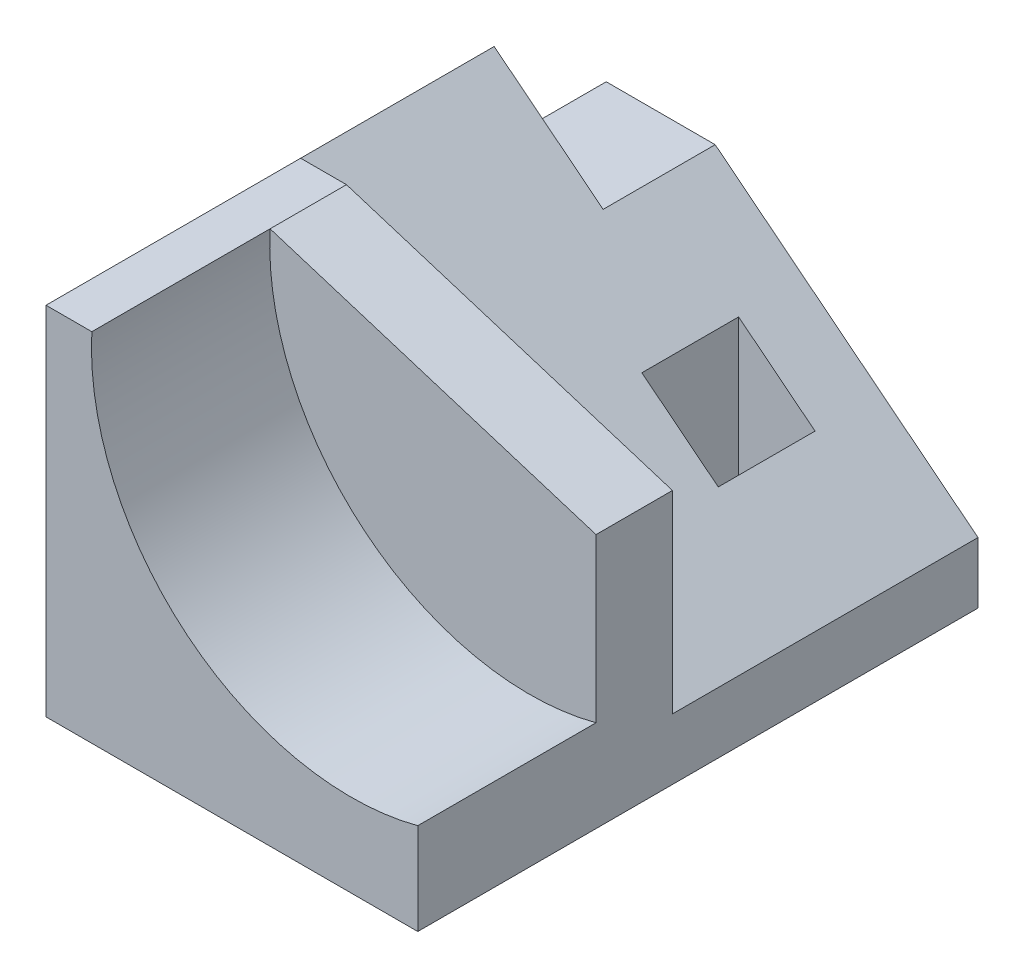
ISO-10303-21;
HEADER;
FILE_DESCRIPTION(('STEP AP214'),'2;1');
FILE_NAME('part.step','',(''),(''),'','','');
FILE_SCHEMA(('AUTOMOTIVE_DESIGN { 1 0 10303 214 1 1 1 1 }'));
ENDSEC;
DATA;
#1=APPLICATION_CONTEXT('core data for automotive mechanical design processes');
#2=APPLICATION_PROTOCOL_DEFINITION('international standard','automotive_design',2000,#1);
#3=PRODUCT_CONTEXT('',#1,'mechanical');
#4=PRODUCT('Part','Part','',(#3));
#5=PRODUCT_RELATED_PRODUCT_CATEGORY('part','',(#4));
#6=PRODUCT_DEFINITION_FORMATION('','',#4);
#7=PRODUCT_DEFINITION_CONTEXT('part definition',#1,'design');
#8=PRODUCT_DEFINITION('design','',#6,#7);
#9=PRODUCT_DEFINITION_SHAPE('','',#8);
#10=(LENGTH_UNIT() NAMED_UNIT(*) SI_UNIT(.MILLI.,.METRE.));
#11=(NAMED_UNIT(*) PLANE_ANGLE_UNIT() SI_UNIT($,.RADIAN.));
#12=(NAMED_UNIT(*) SI_UNIT($,.STERADIAN.) SOLID_ANGLE_UNIT());
#13=UNCERTAINTY_MEASURE_WITH_UNIT(LENGTH_MEASURE(1.E-05),#10,'distance_accuracy_value','');
#14=(GEOMETRIC_REPRESENTATION_CONTEXT(3) GLOBAL_UNCERTAINTY_ASSIGNED_CONTEXT((#13)) GLOBAL_UNIT_ASSIGNED_CONTEXT((#10,
#11,#12)) REPRESENTATION_CONTEXT('',''));
#15=CARTESIAN_POINT('',(0.,0.,0.));
#16=DIRECTION('',(0.,0.,1.));
#17=DIRECTION('',(1.,0.,0.));
#18=AXIS2_PLACEMENT_3D('',#15,#16,#17);
#19=CARTESIAN_POINT('',(0.,35.,0.));
#20=DIRECTION('',(0.,-1.,0.));
#21=DIRECTION('',(0.,0.,-1.));
#22=AXIS2_PLACEMENT_3D('',#19,#20,#21);
#23=PLANE('',#22);
#24=DIRECTION('',(0.,0.,1.));
#25=VECTOR('',#24,1.);
#26=CARTESIAN_POINT('',(-13.75,35.,9.99999999999999));
#27=LINE('',#26,#25);
#28=CARTESIAN_POINT('',(-13.75,35.,9.99999999999999));
#29=VERTEX_POINT('',#28);
#30=CARTESIAN_POINT('',(-13.75,35.,27.5));
#31=VERTEX_POINT('',#30);
#32=EDGE_CURVE('E54',#29,#31,#27,.T.);
#33=ORIENTED_EDGE('',*,*,#32,.F.);
#34=DIRECTION('',(0.,0.,1.));
#35=VECTOR('',#34,1.);
#36=CARTESIAN_POINT('',(-13.75,35.,-27.501));
#37=LINE('',#36,#35);
#38=CARTESIAN_POINT('',(-13.75,35.,2.49999999999999));
#39=VERTEX_POINT('',#38);
#40=EDGE_CURVE('E143',#39,#29,#37,.T.);
#41=ORIENTED_EDGE('',*,*,#40,.F.);
#42=DIRECTION('',(1.,0.,0.));
#43=VECTOR('',#42,1.);
#44=CARTESIAN_POINT('',(0.,35.,2.49999999999999));
#45=LINE('',#44,#43);
#46=CARTESIAN_POINT('',(-18.25,35.,2.49999999999999));
#47=VERTEX_POINT('',#46);
#48=EDGE_CURVE('E154',#47,#39,#45,.T.);
#49=ORIENTED_EDGE('',*,*,#48,.F.);
#50=DIRECTION('',(0.,0.,1.));
#51=VECTOR('',#50,1.);
#52=CARTESIAN_POINT('',(-18.25,35.,27.5));
#53=LINE('',#52,#51);
#54=CARTESIAN_POINT('',(-18.25,35.,27.5));
#55=VERTEX_POINT('',#54);
#56=EDGE_CURVE('E222',#47,#55,#53,.T.);
#57=ORIENTED_EDGE('',*,*,#56,.T.);
#58=DIRECTION('',(1.,0.,0.));
#59=VECTOR('',#58,1.);
#60=CARTESIAN_POINT('',(-18.25,35.,27.5));
#61=LINE('',#60,#59);
#62=EDGE_CURVE('E221',#55,#31,#61,.T.);
#63=ORIENTED_EDGE('',*,*,#62,.T.);
#64=EDGE_LOOP('',(#33,#41,#49,#57,#63));
#65=FACE_BOUND('',#64,.T.);
#66=ADVANCED_FACE('F39',(#65),#23,.F.);
#67=CARTESIAN_POINT('',(18.25,35.,27.5));
#68=DIRECTION('',(-1.,0.,0.));
#69=DIRECTION('',(0.,0.,1.));
#70=AXIS2_PLACEMENT_3D('',#67,#68,#69);
#71=PLANE('',#70);
#72=DIRECTION('',(0.,-1.,0.));
#73=VECTOR('',#72,1.);
#74=CARTESIAN_POINT('',(18.25,0.,2.49999999999999));
#75=LINE('',#74,#73);
#76=CARTESIAN_POINT('',(18.25,25.,2.49999999999999));
#77=VERTEX_POINT('',#76);
#78=CARTESIAN_POINT('',(18.25,5.99999999999999,2.49999999999999));
#79=VERTEX_POINT('',#78);
#80=EDGE_CURVE('E163',#77,#79,#75,.T.);
#81=ORIENTED_EDGE('',*,*,#80,.F.);
#82=DIRECTION('',(0.,0.,1.));
#83=VECTOR('',#82,1.);
#84=CARTESIAN_POINT('',(18.25,25.,-27.501));
#85=LINE('',#84,#83);
#86=CARTESIAN_POINT('',(18.25,25.,9.99999999999999));
#87=VERTEX_POINT('',#86);
#88=EDGE_CURVE('E146',#77,#87,#85,.T.);
#89=ORIENTED_EDGE('',*,*,#88,.T.);
#90=DIRECTION('',(0.,1.,0.));
#91=VECTOR('',#90,1.);
#92=CARTESIAN_POINT('',(18.25,0.,9.99999999999999));
#93=LINE('',#92,#91);
#94=CARTESIAN_POINT('',(18.25,9.,9.99999999999999));
#95=VERTEX_POINT('',#94);
#96=EDGE_CURVE('E274',#95,#87,#93,.T.);
#97=ORIENTED_EDGE('',*,*,#96,.F.);
#98=DIRECTION('',(0.,0.,1.));
#99=VECTOR('',#98,1.);
#100=CARTESIAN_POINT('',(18.25,9.,9.99999999999999));
#101=LINE('',#100,#99);
#102=CARTESIAN_POINT('',(18.25,9.,27.5));
#103=VERTEX_POINT('',#102);
#104=EDGE_CURVE('E168',#95,#103,#101,.T.);
#105=ORIENTED_EDGE('',*,*,#104,.T.);
#106=DIRECTION('',(0.,-1.,0.));
#107=VECTOR('',#106,1.);
#108=CARTESIAN_POINT('',(18.25,35.,27.5));
#109=LINE('',#108,#107);
#110=CARTESIAN_POINT('',(18.25,0.,27.5));
#111=VERTEX_POINT('',#110);
#112=EDGE_CURVE('E224',#103,#111,#109,.T.);
#113=ORIENTED_EDGE('',*,*,#112,.T.);
#114=DIRECTION('',(0.,0.,-1.));
#115=VECTOR('',#114,1.);
#116=CARTESIAN_POINT('',(18.25,0.,27.5));
#117=LINE('',#116,#115);
#118=CARTESIAN_POINT('',(18.25,0.,-27.5));
#119=VERTEX_POINT('',#118);
#120=EDGE_CURVE('E218',#111,#119,#117,.T.);
#121=ORIENTED_EDGE('',*,*,#120,.T.);
#122=DIRECTION('',(0.,-1.,0.));
#123=VECTOR('',#122,1.);
#124=CARTESIAN_POINT('',(18.25,35.,-27.5));
#125=LINE('',#124,#123);
#126=CARTESIAN_POINT('',(18.25,5.99999999999999,-27.5));
#127=VERTEX_POINT('',#126);
#128=EDGE_CURVE('E47',#127,#119,#125,.T.);
#129=ORIENTED_EDGE('',*,*,#128,.F.);
#130=DIRECTION('',(0.,0.,-1.));
#131=VECTOR('',#130,1.);
#132=CARTESIAN_POINT('',(18.25,5.99999999999999,2.49999999999999));
#133=LINE('',#132,#131);
#134=EDGE_CURVE('E173',#79,#127,#133,.T.);
#135=ORIENTED_EDGE('',*,*,#134,.F.);
#136=EDGE_LOOP('',(#81,#89,#97,#105,#113,#121,#129,#135));
#137=FACE_BOUND('',#136,.T.);
#138=ADVANCED_FACE('F41',(#137),#71,.F.);
#139=CARTESIAN_POINT('',(-18.25,35.,-27.5));
#140=DIRECTION('',(0.,0.,1.));
#141=DIRECTION('',(1.,0.,0.));
#142=AXIS2_PLACEMENT_3D('',#139,#140,#141);
#143=PLANE('',#142);
#144=DIRECTION('',(0.782957196595937,-0.622075580857046,0.));
#145=VECTOR('',#144,1.);
#146=CARTESIAN_POINT('',(9.98470033360175,12.5669504198781,-27.5));
#147=LINE('',#146,#145);
#148=CARTESIAN_POINT('',(-7.55172413793104,26.5,-27.5));
#149=VERTEX_POINT('',#148);
#150=EDGE_CURVE('E164',#149,#127,#147,.T.);
#151=ORIENTED_EDGE('',*,*,#150,.T.);
#152=ORIENTED_EDGE('',*,*,#128,.T.);
#153=DIRECTION('',(-1.,0.,0.));
#154=VECTOR('',#153,1.);
#155=CARTESIAN_POINT('',(-18.25,0.,-27.5));
#156=LINE('',#155,#154);
#157=CARTESIAN_POINT('',(-18.25,0.,-27.5));
#158=VERTEX_POINT('',#157);
#159=EDGE_CURVE('E227',#119,#158,#156,.T.);
#160=ORIENTED_EDGE('',*,*,#159,.T.);
#161=DIRECTION('',(0.,-1.,0.));
#162=VECTOR('',#161,1.);
#163=CARTESIAN_POINT('',(-18.25,35.,-27.5));
#164=LINE('',#163,#162);
#165=CARTESIAN_POINT('',(-18.25,26.5,-27.5));
#166=VERTEX_POINT('',#165);
#167=EDGE_CURVE('E239',#166,#158,#164,.T.);
#168=ORIENTED_EDGE('',*,*,#167,.F.);
#169=DIRECTION('',(-1.,0.,0.));
#170=VECTOR('',#169,1.);
#171=CARTESIAN_POINT('',(-18.25,26.5,-27.5));
#172=LINE('',#171,#170);
#173=EDGE_CURVE('E193',#149,#166,#172,.T.);
#174=ORIENTED_EDGE('',*,*,#173,.F.);
#175=EDGE_LOOP('',(#151,#152,#160,#168,#174));
#176=FACE_BOUND('',#175,.T.);
#177=ADVANCED_FACE('F243',(#176),#143,.F.);
#178=CARTESIAN_POINT('',(1.25,35.,-21.));
#179=DIRECTION('',(1.,0.,0.));
#180=DIRECTION('',(0.,0.,-1.));
#181=AXIS2_PLACEMENT_3D('',#178,#179,#180);
#182=PLANE('',#181);
#183=DIRECTION('',(0.,-1.,0.));
#184=VECTOR('',#183,1.);
#185=CARTESIAN_POINT('',(1.25,35.,-21.));
#186=LINE('',#185,#184);
#187=CARTESIAN_POINT('',(1.25,19.5068493150685,-21.));
#188=VERTEX_POINT('',#187);
#189=CARTESIAN_POINT('',(1.25,0.,-21.));
#190=VERTEX_POINT('',#189);
#191=EDGE_CURVE('E210',#188,#190,#186,.T.);
#192=ORIENTED_EDGE('',*,*,#191,.F.);
#193=DIRECTION('',(0.,0.,1.));
#194=VECTOR('',#193,1.);
#195=CARTESIAN_POINT('',(1.25,19.5068493150685,-21.));
#196=LINE('',#195,#194);
#197=CARTESIAN_POINT('',(1.25,19.5068493150685,-11.5));
#198=VERTEX_POINT('',#197);
#199=EDGE_CURVE('E62',#188,#198,#196,.T.);
#200=ORIENTED_EDGE('',*,*,#199,.T.);
#201=DIRECTION('',(0.,-1.,0.));
#202=VECTOR('',#201,1.);
#203=CARTESIAN_POINT('',(1.25,35.,-11.5));
#204=LINE('',#203,#202);
#205=CARTESIAN_POINT('',(1.25,0.,-11.5));
#206=VERTEX_POINT('',#205);
#207=EDGE_CURVE('E216',#198,#206,#204,.T.);
#208=ORIENTED_EDGE('',*,*,#207,.T.);
#209=DIRECTION('',(0.,0.,1.));
#210=VECTOR('',#209,1.);
#211=CARTESIAN_POINT('',(1.25,0.,-21.));
#212=LINE('',#211,#210);
#213=EDGE_CURVE('E198',#190,#206,#212,.T.);
#214=ORIENTED_EDGE('',*,*,#213,.F.);
#215=EDGE_LOOP('',(#192,#200,#208,#214));
#216=FACE_BOUND('',#215,.T.);
#217=ADVANCED_FACE('F300',(#216),#182,.T.);
#218=CARTESIAN_POINT('',(1.25,35.,-11.5));
#219=DIRECTION('',(0.,0.,-1.));
#220=DIRECTION('',(-1.,0.,0.));
#221=AXIS2_PLACEMENT_3D('',#218,#219,#220);
#222=PLANE('',#221);
#223=ORIENTED_EDGE('',*,*,#207,.F.);
#224=DIRECTION('',(0.782957196595937,-0.622075580857046,0.));
#225=VECTOR('',#224,1.);
#226=CARTESIAN_POINT('',(-6.29607155182331,25.5023582192569,-11.5));
#227=LINE('',#226,#225);
#228=CARTESIAN_POINT('',(8.75,13.5479452054794,-11.5));
#229=VERTEX_POINT('',#228);
#230=EDGE_CURVE('E183',#198,#229,#227,.T.);
#231=ORIENTED_EDGE('',*,*,#230,.T.);
#232=DIRECTION('',(0.,-1.,0.));
#233=VECTOR('',#232,1.);
#234=CARTESIAN_POINT('',(8.75,35.,-11.5));
#235=LINE('',#234,#233);
#236=CARTESIAN_POINT('',(8.75,0.,-11.5));
#237=VERTEX_POINT('',#236);
#238=EDGE_CURVE('E214',#229,#237,#235,.T.);
#239=ORIENTED_EDGE('',*,*,#238,.T.);
#240=DIRECTION('',(1.,0.,0.));
#241=VECTOR('',#240,1.);
#242=CARTESIAN_POINT('',(1.25,0.,-11.5));
#243=LINE('',#242,#241);
#244=EDGE_CURVE('E201',#206,#237,#243,.T.);
#245=ORIENTED_EDGE('',*,*,#244,.F.);
#246=EDGE_LOOP('',(#223,#231,#239,#245));
#247=FACE_BOUND('',#246,.T.);
#248=ADVANCED_FACE('F310',(#247),#222,.T.);
#249=CARTESIAN_POINT('',(8.75,35.,-21.));
#250=DIRECTION('',(-1.,0.,0.));
#251=DIRECTION('',(0.,0.,1.));
#252=AXIS2_PLACEMENT_3D('',#249,#250,#251);
#253=PLANE('',#252);
#254=ORIENTED_EDGE('',*,*,#238,.F.);
#255=DIRECTION('',(0.,0.,-1.));
#256=VECTOR('',#255,1.);
#257=CARTESIAN_POINT('',(8.75,13.5479452054794,-21.));
#258=LINE('',#257,#256);
#259=CARTESIAN_POINT('',(8.75,13.5479452054794,-21.));
#260=VERTEX_POINT('',#259);
#261=EDGE_CURVE('E180',#229,#260,#258,.T.);
#262=ORIENTED_EDGE('',*,*,#261,.T.);
#263=DIRECTION('',(0.,-1.,0.));
#264=VECTOR('',#263,1.);
#265=CARTESIAN_POINT('',(8.75,35.,-21.));
#266=LINE('',#265,#264);
#267=CARTESIAN_POINT('',(8.75,0.,-21.));
#268=VERTEX_POINT('',#267);
#269=EDGE_CURVE('E212',#260,#268,#266,.T.);
#270=ORIENTED_EDGE('',*,*,#269,.T.);
#271=DIRECTION('',(0.,0.,-1.));
#272=VECTOR('',#271,1.);
#273=CARTESIAN_POINT('',(8.75,0.,-21.));
#274=LINE('',#273,#272);
#275=EDGE_CURVE('E204',#237,#268,#274,.T.);
#276=ORIENTED_EDGE('',*,*,#275,.F.);
#277=EDGE_LOOP('',(#254,#262,#270,#276));
#278=FACE_BOUND('',#277,.T.);
#279=ADVANCED_FACE('F315',(#278),#253,.T.);
#280=CARTESIAN_POINT('',(1.25,35.,-21.));
#281=DIRECTION('',(0.,0.,1.));
#282=DIRECTION('',(1.,0.,0.));
#283=AXIS2_PLACEMENT_3D('',#280,#281,#282);
#284=PLANE('',#283);
#285=ORIENTED_EDGE('',*,*,#269,.F.);
#286=DIRECTION('',(-0.782957196595937,0.622075580857046,0.));
#287=VECTOR('',#286,1.);
#288=CARTESIAN_POINT('',(-6.29607155182331,25.5023582192569,-21.));
#289=LINE('',#288,#287);
#290=EDGE_CURVE('E178',#260,#188,#289,.T.);
#291=ORIENTED_EDGE('',*,*,#290,.T.);
#292=ORIENTED_EDGE('',*,*,#191,.T.);
#293=DIRECTION('',(-1.,0.,0.));
#294=VECTOR('',#293,1.);
#295=CARTESIAN_POINT('',(1.25,0.,-21.));
#296=LINE('',#295,#294);
#297=EDGE_CURVE('E207',#268,#190,#296,.T.);
#298=ORIENTED_EDGE('',*,*,#297,.F.);
#299=EDGE_LOOP('',(#285,#291,#292,#298));
#300=FACE_BOUND('',#299,.T.);
#301=ADVANCED_FACE('F323',(#300),#284,.T.);
#302=CARTESIAN_POINT('',(-18.25,26.5,-16.5));
#303=DIRECTION('',(0.,0.,1.));
#304=DIRECTION('',(1.,0.,0.));
#305=AXIS2_PLACEMENT_3D('',#302,#303,#304);
#306=PLANE('',#305);
#307=DIRECTION('',(-0.782957196595937,0.622075580857046,0.));
#308=VECTOR('',#307,1.);
#309=CARTESIAN_POINT('',(-14.1100023007017,31.7106867594616,-16.5));
#310=LINE('',#309,#308);
#311=CARTESIAN_POINT('',(-7.55172413793104,26.5,-16.5));
#312=VERTEX_POINT('',#311);
#313=CARTESIAN_POINT('',(-18.25,35.,-16.5));
#314=VERTEX_POINT('',#313);
#315=EDGE_CURVE('E176',#312,#314,#310,.T.);
#316=ORIENTED_EDGE('',*,*,#315,.F.);
#317=DIRECTION('',(1.,0.,0.));
#318=VECTOR('',#317,1.);
#319=CARTESIAN_POINT('',(-18.25,26.5,-16.5));
#320=LINE('',#319,#318);
#321=CARTESIAN_POINT('',(-18.25,26.5,-16.5));
#322=VERTEX_POINT('',#321);
#323=EDGE_CURVE('E190',#322,#312,#320,.T.);
#324=ORIENTED_EDGE('',*,*,#323,.F.);
#325=DIRECTION('',(0.,1.,0.));
#326=VECTOR('',#325,1.);
#327=CARTESIAN_POINT('',(-18.25,26.5,-16.5));
#328=LINE('',#327,#326);
#329=EDGE_CURVE('E195',#322,#314,#328,.T.);
#330=ORIENTED_EDGE('',*,*,#329,.T.);
#331=EDGE_LOOP('',(#316,#324,#330));
#332=FACE_BOUND('',#331,.T.);
#333=ADVANCED_FACE('F272',(#332),#306,.F.);
#334=CARTESIAN_POINT('',(0.,26.5,0.));
#335=DIRECTION('',(0.,1.,0.));
#336=DIRECTION('',(0.,0.,1.));
#337=AXIS2_PLACEMENT_3D('',#334,#335,#336);
#338=PLANE('',#337);
#339=ORIENTED_EDGE('',*,*,#323,.T.);
#340=DIRECTION('',(0.,0.,-1.));
#341=VECTOR('',#340,1.);
#342=CARTESIAN_POINT('',(-7.55172413793104,26.5,0.));
#343=LINE('',#342,#341);
#344=EDGE_CURVE('E12',#312,#149,#343,.T.);
#345=ORIENTED_EDGE('',*,*,#344,.T.);
#346=ORIENTED_EDGE('',*,*,#173,.T.);
#347=DIRECTION('',(0.,0.,1.));
#348=VECTOR('',#347,1.);
#349=CARTESIAN_POINT('',(-18.25,26.5,-27.5));
#350=LINE('',#349,#348);
#351=EDGE_CURVE('E187',#166,#322,#350,.T.);
#352=ORIENTED_EDGE('',*,*,#351,.T.);
#353=EDGE_LOOP('',(#339,#345,#346,#352));
#354=FACE_BOUND('',#353,.T.);
#355=ADVANCED_FACE('F267',(#354),#338,.T.);
#356=CARTESIAN_POINT('',(0.,0.,0.));
#357=DIRECTION('',(0.,-1.,0.));
#358=DIRECTION('',(0.,0.,-1.));
#359=AXIS2_PLACEMENT_3D('',#356,#357,#358);
#360=PLANE('',#359);
#361=ORIENTED_EDGE('',*,*,#120,.F.);
#362=DIRECTION('',(1.,0.,0.));
#363=VECTOR('',#362,1.);
#364=CARTESIAN_POINT('',(-18.25,0.,27.5));
#365=LINE('',#364,#363);
#366=CARTESIAN_POINT('',(-18.25,0.,27.5));
#367=VERTEX_POINT('',#366);
#368=EDGE_CURVE('E232',#367,#111,#365,.T.);
#369=ORIENTED_EDGE('',*,*,#368,.F.);
#370=DIRECTION('',(0.,0.,1.));
#371=VECTOR('',#370,1.);
#372=CARTESIAN_POINT('',(-18.25,0.,27.5));
#373=LINE('',#372,#371);
#374=EDGE_CURVE('E230',#158,#367,#373,.T.);
#375=ORIENTED_EDGE('',*,*,#374,.F.);
#376=ORIENTED_EDGE('',*,*,#159,.F.);
#377=EDGE_LOOP('',(#361,#369,#375,#376));
#378=FACE_BOUND('',#377,.T.);
#379=ORIENTED_EDGE('',*,*,#297,.T.);
#380=ORIENTED_EDGE('',*,*,#213,.T.);
#381=ORIENTED_EDGE('',*,*,#244,.T.);
#382=ORIENTED_EDGE('',*,*,#275,.T.);
#383=EDGE_LOOP('',(#379,#380,#381,#382));
#384=FACE_BOUND('',#383,.T.);
#385=ADVANCED_FACE('F251',(#378,#384),#360,.T.);
#386=CARTESIAN_POINT('',(-18.25,35.,27.5));
#387=DIRECTION('',(1.,0.,0.));
#388=DIRECTION('',(0.,0.,-1.));
#389=AXIS2_PLACEMENT_3D('',#386,#387,#388);
#390=PLANE('',#389);
#391=EDGE_CURVE('E219',#314,#47,#53,.T.);
#392=ORIENTED_EDGE('',*,*,#391,.F.);
#393=ORIENTED_EDGE('',*,*,#329,.F.);
#394=ORIENTED_EDGE('',*,*,#351,.F.);
#395=ORIENTED_EDGE('',*,*,#167,.T.);
#396=ORIENTED_EDGE('',*,*,#374,.T.);
#397=DIRECTION('',(0.,-1.,0.));
#398=VECTOR('',#397,1.);
#399=CARTESIAN_POINT('',(-18.25,35.,27.5));
#400=LINE('',#399,#398);
#401=EDGE_CURVE('E236',#55,#367,#400,.T.);
#402=ORIENTED_EDGE('',*,*,#401,.F.);
#403=ORIENTED_EDGE('',*,*,#56,.F.);
#404=EDGE_LOOP('',(#392,#393,#394,#395,#396,#402,#403));
#405=FACE_BOUND('',#404,.T.);
#406=ADVANCED_FACE('F263',(#405),#390,.F.);
#407=CARTESIAN_POINT('',(-18.25,35.,27.5));
#408=DIRECTION('',(0.,0.,-1.));
#409=DIRECTION('',(-1.,0.,0.));
#410=AXIS2_PLACEMENT_3D('',#407,#408,#409);
#411=PLANE('',#410);
#412=ORIENTED_EDGE('',*,*,#112,.F.);
#413=CARTESIAN_POINT('',(11.7141428560647,33.6481758228488,27.5));
#414=DIRECTION('',(0.,0.,1.));
#415=DIRECTION('',(1.,0.,0.));
#416=AXIS2_PLACEMENT_3D('',#413,#414,#415);
#417=CIRCLE('',#416,25.5);
#418=EDGE_CURVE('E150',#31,#103,#417,.T.);
#419=ORIENTED_EDGE('',*,*,#418,.F.);
#420=ORIENTED_EDGE('',*,*,#62,.F.);
#421=ORIENTED_EDGE('',*,*,#401,.T.);
#422=ORIENTED_EDGE('',*,*,#368,.T.);
#423=EDGE_LOOP('',(#412,#419,#420,#421,#422));
#424=FACE_BOUND('',#423,.T.);
#425=ADVANCED_FACE('F258',(#424),#411,.F.);
#426=CARTESIAN_POINT('',(9.98470033360175,12.5669504198781,2.49999999999999));
#427=DIRECTION('',(0.622075580857046,0.782957196595937,0.));
#428=DIRECTION('',(-0.782957196595937,0.622075580857046,0.));
#429=AXIS2_PLACEMENT_3D('',#426,#427,#428);
#430=PLANE('',#429);
#431=ORIENTED_EDGE('',*,*,#290,.F.);
#432=ORIENTED_EDGE('',*,*,#261,.F.);
#433=ORIENTED_EDGE('',*,*,#230,.F.);
#434=ORIENTED_EDGE('',*,*,#199,.F.);
#435=EDGE_LOOP('',(#431,#432,#433,#434));
#436=FACE_BOUND('',#435,.T.);
#437=ORIENTED_EDGE('',*,*,#315,.T.);
#438=ORIENTED_EDGE('',*,*,#391,.T.);
#439=DIRECTION('',(0.782957196595937,-0.622075580857046,0.));
#440=VECTOR('',#439,1.);
#441=CARTESIAN_POINT('',(9.98470033360175,12.5669504198781,2.49999999999999));
#442=LINE('',#441,#440);
#443=EDGE_CURVE('E162',#47,#79,#442,.T.);
#444=ORIENTED_EDGE('',*,*,#443,.T.);
#445=ORIENTED_EDGE('',*,*,#134,.T.);
#446=ORIENTED_EDGE('',*,*,#150,.F.);
#447=ORIENTED_EDGE('',*,*,#344,.F.);
#448=EDGE_LOOP('',(#437,#438,#444,#445,#446,#447));
#449=FACE_BOUND('',#448,.T.);
#450=ADVANCED_FACE('F270',(#436,#449),#430,.T.);
#451=CARTESIAN_POINT('',(0.,0.,2.49999999999999));
#452=DIRECTION('',(0.,0.,-1.));
#453=DIRECTION('',(-1.,0.,0.));
#454=AXIS2_PLACEMENT_3D('',#451,#452,#453);
#455=PLANE('',#454);
#456=DIRECTION('',(0.95447997803503,-0.298274993135947,0.));
#457=VECTOR('',#456,1.);
#458=CARTESIAN_POINT('',(8.74110320284698,27.9715302491103,2.49999999999999));
#459=LINE('',#458,#457);
#460=EDGE_CURVE('E140',#39,#77,#459,.T.);
#461=ORIENTED_EDGE('',*,*,#460,.T.);
#462=ORIENTED_EDGE('',*,*,#80,.T.);
#463=ORIENTED_EDGE('',*,*,#443,.F.);
#464=ORIENTED_EDGE('',*,*,#48,.T.);
#465=EDGE_LOOP('',(#461,#462,#463,#464));
#466=FACE_BOUND('',#465,.T.);
#467=ADVANCED_FACE('F160',(#466),#455,.T.);
#468=CARTESIAN_POINT('',(11.7141428560647,33.6481758228488,9.99999999999999));
#469=DIRECTION('',(0.,0.,1.));
#470=DIRECTION('',(1.,0.,0.));
#471=AXIS2_PLACEMENT_3D('',#468,#469,#470);
#472=CYLINDRICAL_SURFACE('',#471,25.5);
#473=ORIENTED_EDGE('',*,*,#418,.T.);
#474=ORIENTED_EDGE('',*,*,#104,.F.);
#475=CARTESIAN_POINT('',(11.7141428560647,33.6481758228488,9.99999999999999));
#476=DIRECTION('',(0.,0.,1.));
#477=DIRECTION('',(1.,0.,0.));
#478=AXIS2_PLACEMENT_3D('',#475,#476,#477);
#479=CIRCLE('',#478,25.5);
#480=EDGE_CURVE('E279',#29,#95,#479,.T.);
#481=ORIENTED_EDGE('',*,*,#480,.F.);
#482=ORIENTED_EDGE('',*,*,#32,.T.);
#483=EDGE_LOOP('',(#473,#474,#481,#482));
#484=FACE_BOUND('',#483,.T.);
#485=ADVANCED_FACE('F283',(#484),#472,.F.);
#486=CARTESIAN_POINT('',(0.,0.,9.99999999999999));
#487=DIRECTION('',(0.,0.,1.));
#488=DIRECTION('',(1.,0.,0.));
#489=AXIS2_PLACEMENT_3D('',#486,#487,#488);
#490=PLANE('',#489);
#491=DIRECTION('',(0.95447997803503,-0.298274993135947,0.));
#492=VECTOR('',#491,1.);
#493=CARTESIAN_POINT('',(8.74110320284698,27.9715302491103,9.99999999999999));
#494=LINE('',#493,#492);
#495=EDGE_CURVE('E157',#29,#87,#494,.T.);
#496=ORIENTED_EDGE('',*,*,#495,.F.);
#497=ORIENTED_EDGE('',*,*,#480,.T.);
#498=ORIENTED_EDGE('',*,*,#96,.T.);
#499=EDGE_LOOP('',(#496,#497,#498));
#500=FACE_BOUND('',#499,.T.);
#501=ADVANCED_FACE('F278',(#500),#490,.T.);
#502=CARTESIAN_POINT('',(8.74110320284698,27.9715302491103,-27.501));
#503=DIRECTION('',(-0.298274993135947,-0.95447997803503,0.));
#504=DIRECTION('',(0.95447997803503,-0.298274993135947,0.));
#505=AXIS2_PLACEMENT_3D('',#502,#503,#504);
#506=PLANE('',#505);
#507=ORIENTED_EDGE('',*,*,#40,.T.);
#508=ORIENTED_EDGE('',*,*,#495,.T.);
#509=ORIENTED_EDGE('',*,*,#88,.F.);
#510=ORIENTED_EDGE('',*,*,#460,.F.);
#511=EDGE_LOOP('',(#507,#508,#509,#510));
#512=FACE_BOUND('',#511,.T.);
#513=ADVANCED_FACE('F142',(#512),#506,.F.);
#514=CLOSED_SHELL('',(#66,#138,#177,#217,#248,#279,#301,#333,#355,#385,#406,#425,#450,#467,#485,
#501,#513));
#515=MANIFOLD_SOLID_BREP('B2',#514);
#516=ADVANCED_BREP_SHAPE_REPRESENTATION('',(#18,#515),#14);
#517=SHAPE_DEFINITION_REPRESENTATION(#9,#516);
ENDSEC;
END-ISO-10303-21;
